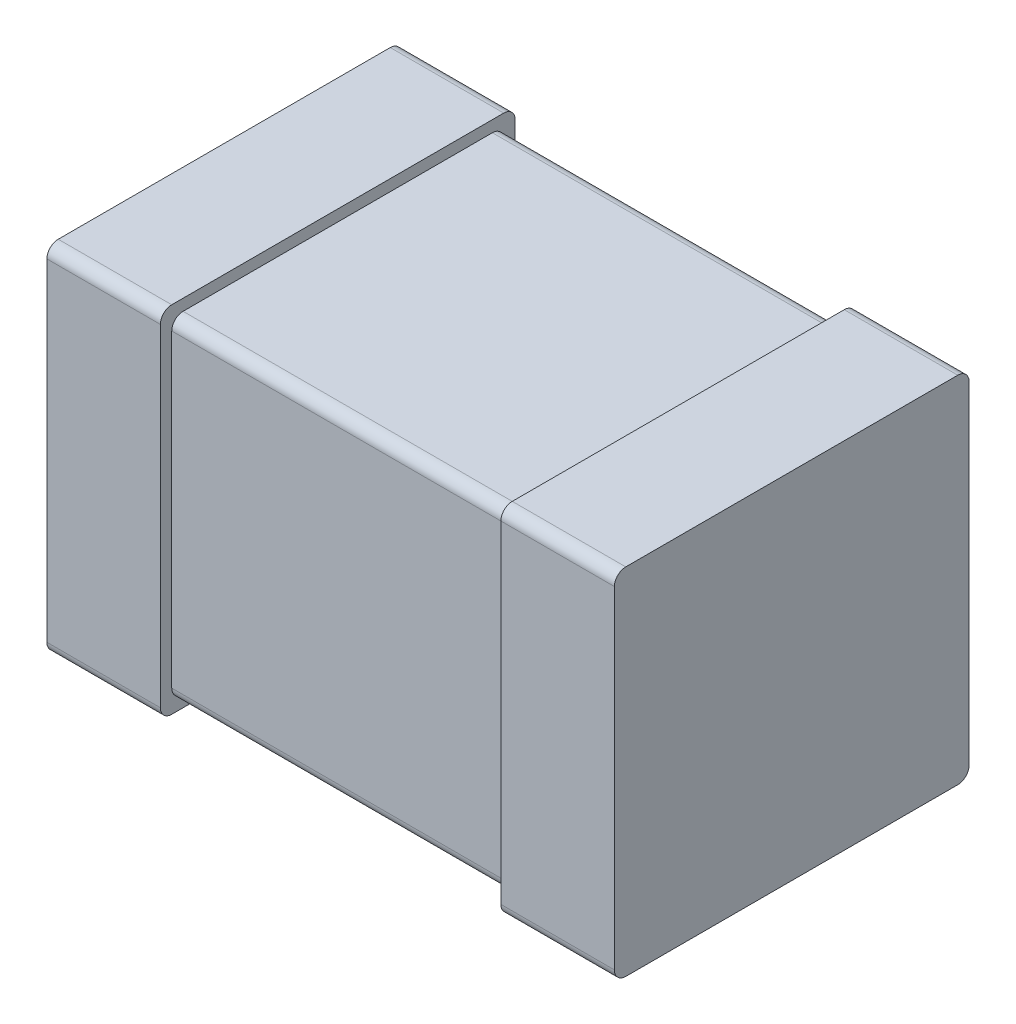
ISO-10303-21;
HEADER;
FILE_DESCRIPTION(('STEP AP214'),'2;1');
FILE_NAME('part.step','',(''),(''),'','','');
FILE_SCHEMA(('AUTOMOTIVE_DESIGN { 1 0 10303 214 1 1 1 1 }'));
ENDSEC;
DATA;
#1=APPLICATION_CONTEXT('core data for automotive mechanical design processes');
#2=APPLICATION_PROTOCOL_DEFINITION('international standard','automotive_design',2000,#1);
#3=PRODUCT_CONTEXT('',#1,'mechanical');
#4=PRODUCT('Part','Part','',(#3));
#5=PRODUCT_RELATED_PRODUCT_CATEGORY('part','',(#4));
#6=PRODUCT_DEFINITION_FORMATION('','',#4);
#7=PRODUCT_DEFINITION_CONTEXT('part definition',#1,'design');
#8=PRODUCT_DEFINITION('design','',#6,#7);
#9=PRODUCT_DEFINITION_SHAPE('','',#8);
#10=(LENGTH_UNIT() NAMED_UNIT(*) SI_UNIT(.MILLI.,.METRE.));
#11=(NAMED_UNIT(*) PLANE_ANGLE_UNIT() SI_UNIT($,.RADIAN.));
#12=(NAMED_UNIT(*) SI_UNIT($,.STERADIAN.) SOLID_ANGLE_UNIT());
#13=UNCERTAINTY_MEASURE_WITH_UNIT(LENGTH_MEASURE(1.E-05),#10,'distance_accuracy_value','');
#14=(GEOMETRIC_REPRESENTATION_CONTEXT(3) GLOBAL_UNCERTAINTY_ASSIGNED_CONTEXT((#13)) GLOBAL_UNIT_ASSIGNED_CONTEXT((#10,
#11,#12)) REPRESENTATION_CONTEXT('',''));
#15=CARTESIAN_POINT('',(0.,0.,0.));
#16=DIRECTION('',(0.,0.,1.));
#17=DIRECTION('',(1.,0.,0.));
#18=AXIS2_PLACEMENT_3D('',#15,#16,#17);
#19=CARTESIAN_POINT('',(1.,-0.625,0.));
#20=DIRECTION('',(1.,0.,0.));
#21=DIRECTION('',(0.,1.,0.));
#22=AXIS2_PLACEMENT_3D('',#19,#20,#21);
#23=PLANE('',#22);
#24=DIRECTION('',(0.,0.,1.));
#25=VECTOR('',#24,1.);
#26=CARTESIAN_POINT('',(1.,-0.625,0.));
#27=LINE('',#26,#25);
#28=CARTESIAN_POINT('',(1.,-0.625,0.04));
#29=VERTEX_POINT('',#28);
#30=CARTESIAN_POINT('',(1.,-0.625,1.21));
#31=VERTEX_POINT('',#30);
#32=EDGE_CURVE('E383',#29,#31,#27,.T.);
#33=ORIENTED_EDGE('',*,*,#32,.F.);
#34=CARTESIAN_POINT('',(1.,-0.585,0.04));
#35=DIRECTION('',(1.,0.,0.));
#36=DIRECTION('',(0.,0.,1.));
#37=AXIS2_PLACEMENT_3D('',#34,#35,#36);
#38=CIRCLE('',#37,0.04);
#39=CARTESIAN_POINT('',(1.,-0.585,0.));
#40=VERTEX_POINT('',#39);
#41=EDGE_CURVE('E272',#29,#40,#38,.T.);
#42=ORIENTED_EDGE('',*,*,#41,.T.);
#43=DIRECTION('',(0.,1.,0.));
#44=VECTOR('',#43,1.);
#45=CARTESIAN_POINT('',(1.,-0.625,0.));
#46=LINE('',#45,#44);
#47=CARTESIAN_POINT('',(1.,0.585,0.));
#48=VERTEX_POINT('',#47);
#49=EDGE_CURVE('E423',#40,#48,#46,.T.);
#50=ORIENTED_EDGE('',*,*,#49,.T.);
#51=CARTESIAN_POINT('',(1.,0.585,0.04));
#52=DIRECTION('',(-1.,0.,0.));
#53=DIRECTION('',(0.,0.,1.));
#54=AXIS2_PLACEMENT_3D('',#51,#52,#53);
#55=CIRCLE('',#54,0.04);
#56=CARTESIAN_POINT('',(1.,0.625,0.04));
#57=VERTEX_POINT('',#56);
#58=EDGE_CURVE('E302',#57,#48,#55,.T.);
#59=ORIENTED_EDGE('',*,*,#58,.F.);
#60=DIRECTION('',(0.,0.,1.));
#61=VECTOR('',#60,1.);
#62=CARTESIAN_POINT('',(1.,0.625,0.));
#63=LINE('',#62,#61);
#64=CARTESIAN_POINT('',(1.,0.625,1.21));
#65=VERTEX_POINT('',#64);
#66=EDGE_CURVE('E11',#57,#65,#63,.T.);
#67=ORIENTED_EDGE('',*,*,#66,.T.);
#68=CARTESIAN_POINT('',(1.,0.585,1.21));
#69=DIRECTION('',(1.,0.,0.));
#70=DIRECTION('',(0.,0.,1.));
#71=AXIS2_PLACEMENT_3D('',#68,#69,#70);
#72=CIRCLE('',#71,0.04);
#73=CARTESIAN_POINT('',(1.,0.585,1.25));
#74=VERTEX_POINT('',#73);
#75=EDGE_CURVE('E299',#65,#74,#72,.T.);
#76=ORIENTED_EDGE('',*,*,#75,.T.);
#77=DIRECTION('',(0.,1.,0.));
#78=VECTOR('',#77,1.);
#79=CARTESIAN_POINT('',(1.,-0.625,1.25));
#80=LINE('',#79,#78);
#81=CARTESIAN_POINT('',(1.,-0.585,1.25));
#82=VERTEX_POINT('',#81);
#83=EDGE_CURVE('E427',#82,#74,#80,.T.);
#84=ORIENTED_EDGE('',*,*,#83,.F.);
#85=CARTESIAN_POINT('',(1.,-0.585,1.21));
#86=DIRECTION('',(-1.,0.,0.));
#87=DIRECTION('',(0.,0.,1.));
#88=AXIS2_PLACEMENT_3D('',#85,#86,#87);
#89=CIRCLE('',#88,0.04);
#90=EDGE_CURVE('E268',#31,#82,#89,.T.);
#91=ORIENTED_EDGE('',*,*,#90,.F.);
#92=EDGE_LOOP('',(#33,#42,#50,#59,#67,#76,#84,#91));
#93=FACE_BOUND('',#92,.T.);
#94=ADVANCED_FACE('F17',(#93),#23,.T.);
#95=CARTESIAN_POINT('',(0.6,0.625,0.));
#96=DIRECTION('',(0.,1.,0.));
#97=DIRECTION('',(1.,0.,0.));
#98=AXIS2_PLACEMENT_3D('',#95,#96,#97);
#99=PLANE('',#98);
#100=ORIENTED_EDGE('',*,*,#66,.F.);
#101=DIRECTION('',(1.,0.,0.));
#102=VECTOR('',#101,1.);
#103=CARTESIAN_POINT('',(0.6,0.625,0.04));
#104=LINE('',#103,#102);
#105=CARTESIAN_POINT('',(0.6,0.625,0.04));
#106=VERTEX_POINT('',#105);
#107=EDGE_CURVE('E309',#106,#57,#104,.T.);
#108=ORIENTED_EDGE('',*,*,#107,.F.);
#109=DIRECTION('',(0.,0.,1.));
#110=VECTOR('',#109,1.);
#111=CARTESIAN_POINT('',(0.6,0.625,0.));
#112=LINE('',#111,#110);
#113=CARTESIAN_POINT('',(0.6,0.625,1.21));
#114=VERTEX_POINT('',#113);
#115=EDGE_CURVE('E283',#106,#114,#112,.T.);
#116=ORIENTED_EDGE('',*,*,#115,.T.);
#117=DIRECTION('',(1.,0.,0.));
#118=VECTOR('',#117,1.);
#119=CARTESIAN_POINT('',(0.6,0.625,1.21));
#120=LINE('',#119,#118);
#121=EDGE_CURVE('E25',#114,#65,#120,.T.);
#122=ORIENTED_EDGE('',*,*,#121,.T.);
#123=EDGE_LOOP('',(#100,#108,#116,#122));
#124=FACE_BOUND('',#123,.T.);
#125=ADVANCED_FACE('F440',(#124),#99,.T.);
#126=CARTESIAN_POINT('',(0.6,0.585,1.21));
#127=DIRECTION('',(1.,0.,0.));
#128=DIRECTION('',(0.,1.,0.));
#129=AXIS2_PLACEMENT_3D('',#126,#127,#128);
#130=CYLINDRICAL_SURFACE('',#129,0.04);
#131=CARTESIAN_POINT('',(0.6,0.585,1.21));
#132=DIRECTION('',(1.,0.,0.));
#133=DIRECTION('',(0.,0.,1.));
#134=AXIS2_PLACEMENT_3D('',#131,#132,#133);
#135=CIRCLE('',#134,0.04);
#136=CARTESIAN_POINT('',(0.6,0.585,1.25));
#137=VERTEX_POINT('',#136);
#138=EDGE_CURVE('E288',#114,#137,#135,.T.);
#139=ORIENTED_EDGE('',*,*,#138,.T.);
#140=DIRECTION('',(1.,0.,0.));
#141=VECTOR('',#140,1.);
#142=CARTESIAN_POINT('',(0.6,0.585,1.25));
#143=LINE('',#142,#141);
#144=EDGE_CURVE('E431',#137,#74,#143,.T.);
#145=ORIENTED_EDGE('',*,*,#144,.T.);
#146=ORIENTED_EDGE('',*,*,#75,.F.);
#147=ORIENTED_EDGE('',*,*,#121,.F.);
#148=EDGE_LOOP('',(#139,#145,#146,#147));
#149=FACE_BOUND('',#148,.T.);
#150=ADVANCED_FACE('F444',(#149),#130,.T.);
#151=CARTESIAN_POINT('',(0.6,0.585,0.04));
#152=DIRECTION('',(1.,0.,0.));
#153=DIRECTION('',(0.,1.,0.));
#154=AXIS2_PLACEMENT_3D('',#151,#152,#153);
#155=CYLINDRICAL_SURFACE('',#154,0.04);
#156=ORIENTED_EDGE('',*,*,#107,.T.);
#157=ORIENTED_EDGE('',*,*,#58,.T.);
#158=DIRECTION('',(1.,0.,0.));
#159=VECTOR('',#158,1.);
#160=CARTESIAN_POINT('',(0.6,0.585,0.));
#161=LINE('',#160,#159);
#162=CARTESIAN_POINT('',(0.6,0.585,0.));
#163=VERTEX_POINT('',#162);
#164=EDGE_CURVE('E419',#163,#48,#161,.T.);
#165=ORIENTED_EDGE('',*,*,#164,.F.);
#166=CARTESIAN_POINT('',(0.6,0.585,0.04));
#167=DIRECTION('',(-1.,0.,0.));
#168=DIRECTION('',(0.,0.,1.));
#169=AXIS2_PLACEMENT_3D('',#166,#167,#168);
#170=CIRCLE('',#169,0.04);
#171=EDGE_CURVE('E287',#106,#163,#170,.T.);
#172=ORIENTED_EDGE('',*,*,#171,.F.);
#173=EDGE_LOOP('',(#156,#157,#165,#172));
#174=FACE_BOUND('',#173,.T.);
#175=ADVANCED_FACE('F465',(#174),#155,.T.);
#176=CARTESIAN_POINT('',(0.6,-0.625,1.25));
#177=DIRECTION('',(0.,0.,1.));
#178=DIRECTION('',(1.,0.,0.));
#179=AXIS2_PLACEMENT_3D('',#176,#177,#178);
#180=PLANE('',#179);
#181=DIRECTION('',(0.,1.,0.));
#182=VECTOR('',#181,1.);
#183=CARTESIAN_POINT('',(0.6,-0.625,1.25));
#184=LINE('',#183,#182);
#185=CARTESIAN_POINT('',(0.6,-0.585,1.25));
#186=VERTEX_POINT('',#185);
#187=EDGE_CURVE('E293',#186,#137,#184,.T.);
#188=ORIENTED_EDGE('',*,*,#187,.F.);
#189=DIRECTION('',(1.,0.,0.));
#190=VECTOR('',#189,1.);
#191=CARTESIAN_POINT('',(0.6,-0.585,1.25));
#192=LINE('',#191,#190);
#193=EDGE_CURVE('E271',#186,#82,#192,.T.);
#194=ORIENTED_EDGE('',*,*,#193,.T.);
#195=ORIENTED_EDGE('',*,*,#83,.T.);
#196=ORIENTED_EDGE('',*,*,#144,.F.);
#197=EDGE_LOOP('',(#188,#194,#195,#196));
#198=FACE_BOUND('',#197,.T.);
#199=ADVANCED_FACE('F448',(#198),#180,.T.);
#200=CARTESIAN_POINT('',(0.6,-0.625,0.));
#201=DIRECTION('',(0.,0.,1.));
#202=DIRECTION('',(1.,0.,0.));
#203=AXIS2_PLACEMENT_3D('',#200,#201,#202);
#204=PLANE('',#203);
#205=ORIENTED_EDGE('',*,*,#164,.T.);
#206=ORIENTED_EDGE('',*,*,#49,.F.);
#207=DIRECTION('',(1.,0.,0.));
#208=VECTOR('',#207,1.);
#209=CARTESIAN_POINT('',(0.6,-0.585,0.));
#210=LINE('',#209,#208);
#211=CARTESIAN_POINT('',(0.6,-0.585,0.));
#212=VERTEX_POINT('',#211);
#213=EDGE_CURVE('E327',#212,#40,#210,.T.);
#214=ORIENTED_EDGE('',*,*,#213,.F.);
#215=DIRECTION('',(0.,1.,0.));
#216=VECTOR('',#215,1.);
#217=CARTESIAN_POINT('',(0.6,-0.625,0.));
#218=LINE('',#217,#216);
#219=EDGE_CURVE('E393',#212,#163,#218,.T.);
#220=ORIENTED_EDGE('',*,*,#219,.T.);
#221=EDGE_LOOP('',(#205,#206,#214,#220));
#222=FACE_BOUND('',#221,.T.);
#223=ADVANCED_FACE('F462',(#222),#204,.F.);
#224=CARTESIAN_POINT('',(0.6,-0.585,1.21));
#225=DIRECTION('',(1.,0.,0.));
#226=DIRECTION('',(0.,-1.,0.));
#227=AXIS2_PLACEMENT_3D('',#224,#225,#226);
#228=CYLINDRICAL_SURFACE('',#227,0.04);
#229=DIRECTION('',(1.,0.,0.));
#230=VECTOR('',#229,1.);
#231=CARTESIAN_POINT('',(0.6,-0.625,1.21));
#232=LINE('',#231,#230);
#233=CARTESIAN_POINT('',(0.6,-0.625,1.21));
#234=VERTEX_POINT('',#233);
#235=EDGE_CURVE('E405',#234,#31,#232,.T.);
#236=ORIENTED_EDGE('',*,*,#235,.T.);
#237=ORIENTED_EDGE('',*,*,#90,.T.);
#238=ORIENTED_EDGE('',*,*,#193,.F.);
#239=CARTESIAN_POINT('',(0.6,-0.585,1.21));
#240=DIRECTION('',(-1.,0.,0.));
#241=DIRECTION('',(0.,0.,1.));
#242=AXIS2_PLACEMENT_3D('',#239,#240,#241);
#243=CIRCLE('',#242,0.04);
#244=EDGE_CURVE('E289',#234,#186,#243,.T.);
#245=ORIENTED_EDGE('',*,*,#244,.F.);
#246=EDGE_LOOP('',(#236,#237,#238,#245));
#247=FACE_BOUND('',#246,.T.);
#248=ADVANCED_FACE('F451',(#247),#228,.T.);
#249=CARTESIAN_POINT('',(0.6,-0.585,0.04));
#250=DIRECTION('',(1.,0.,0.));
#251=DIRECTION('',(0.,-1.,0.));
#252=AXIS2_PLACEMENT_3D('',#249,#250,#251);
#253=CYLINDRICAL_SURFACE('',#252,0.04);
#254=CARTESIAN_POINT('',(0.6,-0.585,0.04));
#255=DIRECTION('',(1.,0.,0.));
#256=DIRECTION('',(0.,0.,1.));
#257=AXIS2_PLACEMENT_3D('',#254,#255,#256);
#258=CIRCLE('',#257,0.04);
#259=CARTESIAN_POINT('',(0.6,-0.625,0.04));
#260=VERTEX_POINT('',#259);
#261=EDGE_CURVE('E397',#260,#212,#258,.T.);
#262=ORIENTED_EDGE('',*,*,#261,.T.);
#263=ORIENTED_EDGE('',*,*,#213,.T.);
#264=ORIENTED_EDGE('',*,*,#41,.F.);
#265=DIRECTION('',(1.,0.,0.));
#266=VECTOR('',#265,1.);
#267=CARTESIAN_POINT('',(0.6,-0.625,0.04));
#268=LINE('',#267,#266);
#269=EDGE_CURVE('E409',#260,#29,#268,.T.);
#270=ORIENTED_EDGE('',*,*,#269,.F.);
#271=EDGE_LOOP('',(#262,#263,#264,#270));
#272=FACE_BOUND('',#271,.T.);
#273=ADVANCED_FACE('F460',(#272),#253,.T.);
#274=CARTESIAN_POINT('',(0.6,-0.625,0.));
#275=DIRECTION('',(0.,1.,0.));
#276=DIRECTION('',(1.,0.,0.));
#277=AXIS2_PLACEMENT_3D('',#274,#275,#276);
#278=PLANE('',#277);
#279=ORIENTED_EDGE('',*,*,#235,.F.);
#280=DIRECTION('',(0.,0.,1.));
#281=VECTOR('',#280,1.);
#282=CARTESIAN_POINT('',(0.6,-0.625,0.));
#283=LINE('',#282,#281);
#284=EDGE_CURVE('E401',#260,#234,#283,.T.);
#285=ORIENTED_EDGE('',*,*,#284,.F.);
#286=ORIENTED_EDGE('',*,*,#269,.T.);
#287=ORIENTED_EDGE('',*,*,#32,.T.);
#288=EDGE_LOOP('',(#279,#285,#286,#287));
#289=FACE_BOUND('',#288,.T.);
#290=ADVANCED_FACE('F454',(#289),#278,.F.);
#291=CARTESIAN_POINT('',(0.6,-0.625,0.));
#292=DIRECTION('',(1.,0.,0.));
#293=DIRECTION('',(0.,1.,0.));
#294=AXIS2_PLACEMENT_3D('',#291,#292,#293);
#295=PLANE('',#294);
#296=DIRECTION('',(0.,1.,0.));
#297=VECTOR('',#296,1.);
#298=CARTESIAN_POINT('',(0.6,-0.585,0.04));
#299=LINE('',#298,#297);
#300=CARTESIAN_POINT('',(0.6,-0.545,0.04));
#301=VERTEX_POINT('',#300);
#302=CARTESIAN_POINT('',(0.6,0.545,0.04));
#303=VERTEX_POINT('',#302);
#304=EDGE_CURVE('E354',#301,#303,#299,.T.);
#305=ORIENTED_EDGE('',*,*,#304,.T.);
#306=CARTESIAN_POINT('',(0.6,0.545,0.08));
#307=DIRECTION('',(-1.,0.,0.));
#308=DIRECTION('',(0.,0.,1.));
#309=AXIS2_PLACEMENT_3D('',#306,#307,#308);
#310=CIRCLE('',#309,0.04);
#311=CARTESIAN_POINT('',(0.6,0.585,0.08));
#312=VERTEX_POINT('',#311);
#313=EDGE_CURVE('E340',#312,#303,#310,.T.);
#314=ORIENTED_EDGE('',*,*,#313,.F.);
#315=DIRECTION('',(0.,0.,1.));
#316=VECTOR('',#315,1.);
#317=CARTESIAN_POINT('',(0.6,0.585,0.04));
#318=LINE('',#317,#316);
#319=CARTESIAN_POINT('',(0.6,0.585,1.17));
#320=VERTEX_POINT('',#319);
#321=EDGE_CURVE('E343',#312,#320,#318,.T.);
#322=ORIENTED_EDGE('',*,*,#321,.T.);
#323=CARTESIAN_POINT('',(0.6,0.545,1.17));
#324=DIRECTION('',(1.,0.,0.));
#325=DIRECTION('',(0.,0.,1.));
#326=AXIS2_PLACEMENT_3D('',#323,#324,#325);
#327=CIRCLE('',#326,0.04);
#328=CARTESIAN_POINT('',(0.6,0.545,1.21));
#329=VERTEX_POINT('',#328);
#330=EDGE_CURVE('E366',#320,#329,#327,.T.);
#331=ORIENTED_EDGE('',*,*,#330,.T.);
#332=DIRECTION('',(0.,1.,0.));
#333=VECTOR('',#332,1.);
#334=CARTESIAN_POINT('',(0.6,-0.585,1.21));
#335=LINE('',#334,#333);
#336=CARTESIAN_POINT('',(0.6,-0.545,1.21));
#337=VERTEX_POINT('',#336);
#338=EDGE_CURVE('E374',#337,#329,#335,.T.);
#339=ORIENTED_EDGE('',*,*,#338,.F.);
#340=CARTESIAN_POINT('',(0.6,-0.545,1.17));
#341=DIRECTION('',(-1.,0.,0.));
#342=DIRECTION('',(0.,0.,1.));
#343=AXIS2_PLACEMENT_3D('',#340,#341,#342);
#344=CIRCLE('',#343,0.04);
#345=CARTESIAN_POINT('',(0.6,-0.585,1.17));
#346=VERTEX_POINT('',#345);
#347=EDGE_CURVE('E330',#346,#337,#344,.T.);
#348=ORIENTED_EDGE('',*,*,#347,.F.);
#349=DIRECTION('',(0.,0.,1.));
#350=VECTOR('',#349,1.);
#351=CARTESIAN_POINT('',(0.6,-0.585,0.04));
#352=LINE('',#351,#350);
#353=CARTESIAN_POINT('',(0.6,-0.585,0.08));
#354=VERTEX_POINT('',#353);
#355=EDGE_CURVE('E294',#354,#346,#352,.T.);
#356=ORIENTED_EDGE('',*,*,#355,.F.);
#357=CARTESIAN_POINT('',(0.6,-0.545,0.08));
#358=DIRECTION('',(1.,0.,0.));
#359=DIRECTION('',(0.,0.,1.));
#360=AXIS2_PLACEMENT_3D('',#357,#358,#359);
#361=CIRCLE('',#360,0.04);
#362=EDGE_CURVE('E319',#354,#301,#361,.T.);
#363=ORIENTED_EDGE('',*,*,#362,.T.);
#364=EDGE_LOOP('',(#305,#314,#322,#331,#339,#348,#356,#363));
#365=FACE_BOUND('',#364,.T.);
#366=ORIENTED_EDGE('',*,*,#244,.T.);
#367=ORIENTED_EDGE('',*,*,#187,.T.);
#368=ORIENTED_EDGE('',*,*,#138,.F.);
#369=ORIENTED_EDGE('',*,*,#115,.F.);
#370=ORIENTED_EDGE('',*,*,#171,.T.);
#371=ORIENTED_EDGE('',*,*,#219,.F.);
#372=ORIENTED_EDGE('',*,*,#261,.F.);
#373=ORIENTED_EDGE('',*,*,#284,.T.);
#374=EDGE_LOOP('',(#366,#367,#368,#369,#370,#371,#372,#373));
#375=FACE_BOUND('',#374,.T.);
#376=ADVANCED_FACE('F457',(#365,#375),#295,.F.);
#377=CARTESIAN_POINT('',(-0.6,-0.585,0.04));
#378=DIRECTION('',(0.,1.,0.));
#379=DIRECTION('',(1.,0.,0.));
#380=AXIS2_PLACEMENT_3D('',#377,#378,#379);
#381=PLANE('',#380);
#382=DIRECTION('',(1.,0.,0.));
#383=VECTOR('',#382,1.);
#384=CARTESIAN_POINT('',(-0.6,-0.585,1.17));
#385=LINE('',#384,#383);
#386=CARTESIAN_POINT('',(-0.6,-0.585,1.17));
#387=VERTEX_POINT('',#386);
#388=EDGE_CURVE('E377',#387,#346,#385,.T.);
#389=ORIENTED_EDGE('',*,*,#388,.F.);
#390=DIRECTION('',(0.,0.,1.));
#391=VECTOR('',#390,1.);
#392=CARTESIAN_POINT('',(-0.6,-0.585,0.04));
#393=LINE('',#392,#391);
#394=CARTESIAN_POINT('',(-0.6,-0.585,0.08));
#395=VERTEX_POINT('',#394);
#396=EDGE_CURVE('E298',#395,#387,#393,.T.);
#397=ORIENTED_EDGE('',*,*,#396,.F.);
#398=DIRECTION('',(1.,0.,0.));
#399=VECTOR('',#398,1.);
#400=CARTESIAN_POINT('',(-0.6,-0.585,0.08));
#401=LINE('',#400,#399);
#402=EDGE_CURVE('E314',#395,#354,#401,.T.);
#403=ORIENTED_EDGE('',*,*,#402,.T.);
#404=ORIENTED_EDGE('',*,*,#355,.T.);
#405=EDGE_LOOP('',(#389,#397,#403,#404));
#406=FACE_BOUND('',#405,.T.);
#407=ADVANCED_FACE('F552',(#406),#381,.F.);
#408=CARTESIAN_POINT('',(-0.6,-0.545,1.17));
#409=DIRECTION('',(1.,0.,0.));
#410=DIRECTION('',(0.,-1.,0.));
#411=AXIS2_PLACEMENT_3D('',#408,#409,#410);
#412=CYLINDRICAL_SURFACE('',#411,0.04);
#413=ORIENTED_EDGE('',*,*,#388,.T.);
#414=ORIENTED_EDGE('',*,*,#347,.T.);
#415=DIRECTION('',(1.,0.,0.));
#416=VECTOR('',#415,1.);
#417=CARTESIAN_POINT('',(-0.6,-0.545,1.21));
#418=LINE('',#417,#416);
#419=CARTESIAN_POINT('',(-0.6,-0.545,1.21));
#420=VERTEX_POINT('',#419);
#421=EDGE_CURVE('E370',#420,#337,#418,.T.);
#422=ORIENTED_EDGE('',*,*,#421,.F.);
#423=CARTESIAN_POINT('',(-0.6,-0.545,1.17));
#424=DIRECTION('',(-1.,0.,0.));
#425=DIRECTION('',(0.,0.,1.));
#426=AXIS2_PLACEMENT_3D('',#423,#424,#425);
#427=CIRCLE('',#426,0.04);
#428=EDGE_CURVE('E306',#387,#420,#427,.T.);
#429=ORIENTED_EDGE('',*,*,#428,.F.);
#430=EDGE_LOOP('',(#413,#414,#422,#429));
#431=FACE_BOUND('',#430,.T.);
#432=ADVANCED_FACE('F564',(#431),#412,.T.);
#433=CARTESIAN_POINT('',(-0.6,-0.585,1.21));
#434=DIRECTION('',(0.,0.,1.));
#435=DIRECTION('',(1.,0.,0.));
#436=AXIS2_PLACEMENT_3D('',#433,#434,#435);
#437=PLANE('',#436);
#438=DIRECTION('',(0.,1.,0.));
#439=VECTOR('',#438,1.);
#440=CARTESIAN_POINT('',(-0.6,-0.585,1.21));
#441=LINE('',#440,#439);
#442=CARTESIAN_POINT('',(-0.6,0.545,1.21));
#443=VERTEX_POINT('',#442);
#444=EDGE_CURVE('E313',#420,#443,#441,.T.);
#445=ORIENTED_EDGE('',*,*,#444,.F.);
#446=ORIENTED_EDGE('',*,*,#421,.T.);
#447=ORIENTED_EDGE('',*,*,#338,.T.);
#448=DIRECTION('',(1.,0.,0.));
#449=VECTOR('',#448,1.);
#450=CARTESIAN_POINT('',(-0.6,0.545,1.21));
#451=LINE('',#450,#449);
#452=EDGE_CURVE('E362',#443,#329,#451,.T.);
#453=ORIENTED_EDGE('',*,*,#452,.F.);
#454=EDGE_LOOP('',(#445,#446,#447,#453));
#455=FACE_BOUND('',#454,.T.);
#456=ADVANCED_FACE('F577',(#455),#437,.T.);
#457=CARTESIAN_POINT('',(-0.6,0.545,1.17));
#458=DIRECTION('',(1.,0.,0.));
#459=DIRECTION('',(0.,1.,0.));
#460=AXIS2_PLACEMENT_3D('',#457,#458,#459);
#461=CYLINDRICAL_SURFACE('',#460,0.04);
#462=CARTESIAN_POINT('',(-0.6,0.545,1.17));
#463=DIRECTION('',(1.,0.,0.));
#464=DIRECTION('',(0.,0.,1.));
#465=AXIS2_PLACEMENT_3D('',#462,#463,#464);
#466=CIRCLE('',#465,0.04);
#467=CARTESIAN_POINT('',(-0.6,0.585,1.17));
#468=VERTEX_POINT('',#467);
#469=EDGE_CURVE('E323',#468,#443,#466,.T.);
#470=ORIENTED_EDGE('',*,*,#469,.T.);
#471=ORIENTED_EDGE('',*,*,#452,.T.);
#472=ORIENTED_EDGE('',*,*,#330,.F.);
#473=DIRECTION('',(1.,0.,0.));
#474=VECTOR('',#473,1.);
#475=CARTESIAN_POINT('',(-0.6,0.585,1.17));
#476=LINE('',#475,#474);
#477=EDGE_CURVE('E358',#468,#320,#476,.T.);
#478=ORIENTED_EDGE('',*,*,#477,.F.);
#479=EDGE_LOOP('',(#470,#471,#472,#478));
#480=FACE_BOUND('',#479,.T.);
#481=ADVANCED_FACE('F590',(#480),#461,.T.);
#482=CARTESIAN_POINT('',(-0.6,0.585,0.04));
#483=DIRECTION('',(0.,1.,0.));
#484=DIRECTION('',(1.,0.,0.));
#485=AXIS2_PLACEMENT_3D('',#482,#483,#484);
#486=PLANE('',#485);
#487=ORIENTED_EDGE('',*,*,#321,.F.);
#488=DIRECTION('',(1.,0.,0.));
#489=VECTOR('',#488,1.);
#490=CARTESIAN_POINT('',(-0.6,0.585,0.08));
#491=LINE('',#490,#489);
#492=CARTESIAN_POINT('',(-0.6,0.585,0.08));
#493=VERTEX_POINT('',#492);
#494=EDGE_CURVE('E267',#493,#312,#491,.T.);
#495=ORIENTED_EDGE('',*,*,#494,.F.);
#496=DIRECTION('',(0.,0.,1.));
#497=VECTOR('',#496,1.);
#498=CARTESIAN_POINT('',(-0.6,0.585,0.04));
#499=LINE('',#498,#497);
#500=EDGE_CURVE('E334',#493,#468,#499,.T.);
#501=ORIENTED_EDGE('',*,*,#500,.T.);
#502=ORIENTED_EDGE('',*,*,#477,.T.);
#503=EDGE_LOOP('',(#487,#495,#501,#502));
#504=FACE_BOUND('',#503,.T.);
#505=ADVANCED_FACE('F603',(#504),#486,.T.);
#506=CARTESIAN_POINT('',(-0.6,0.545,0.08));
#507=DIRECTION('',(1.,0.,0.));
#508=DIRECTION('',(0.,1.,0.));
#509=AXIS2_PLACEMENT_3D('',#506,#507,#508);
#510=CYLINDRICAL_SURFACE('',#509,0.04);
#511=ORIENTED_EDGE('',*,*,#494,.T.);
#512=ORIENTED_EDGE('',*,*,#313,.T.);
#513=DIRECTION('',(1.,0.,0.));
#514=VECTOR('',#513,1.);
#515=CARTESIAN_POINT('',(-0.6,0.545,0.04));
#516=LINE('',#515,#514);
#517=CARTESIAN_POINT('',(-0.6,0.545,0.04));
#518=VERTEX_POINT('',#517);
#519=EDGE_CURVE('E318',#518,#303,#516,.T.);
#520=ORIENTED_EDGE('',*,*,#519,.F.);
#521=CARTESIAN_POINT('',(-0.6,0.545,0.08));
#522=DIRECTION('',(-1.,0.,0.));
#523=DIRECTION('',(0.,0.,1.));
#524=AXIS2_PLACEMENT_3D('',#521,#522,#523);
#525=CIRCLE('',#524,0.04);
#526=EDGE_CURVE('E335',#493,#518,#525,.T.);
#527=ORIENTED_EDGE('',*,*,#526,.F.);
#528=EDGE_LOOP('',(#511,#512,#520,#527));
#529=FACE_BOUND('',#528,.T.);
#530=ADVANCED_FACE('F615',(#529),#510,.T.);
#531=CARTESIAN_POINT('',(-0.6,-0.585,0.04));
#532=DIRECTION('',(0.,0.,1.));
#533=DIRECTION('',(1.,0.,0.));
#534=AXIS2_PLACEMENT_3D('',#531,#532,#533);
#535=PLANE('',#534);
#536=ORIENTED_EDGE('',*,*,#519,.T.);
#537=ORIENTED_EDGE('',*,*,#304,.F.);
#538=DIRECTION('',(1.,0.,0.));
#539=VECTOR('',#538,1.);
#540=CARTESIAN_POINT('',(-0.6,-0.545,0.04));
#541=LINE('',#540,#539);
#542=CARTESIAN_POINT('',(-0.6,-0.545,0.04));
#543=VERTEX_POINT('',#542);
#544=EDGE_CURVE('E344',#543,#301,#541,.T.);
#545=ORIENTED_EDGE('',*,*,#544,.F.);
#546=DIRECTION('',(0.,1.,0.));
#547=VECTOR('',#546,1.);
#548=CARTESIAN_POINT('',(-0.6,-0.585,0.04));
#549=LINE('',#548,#547);
#550=EDGE_CURVE('E339',#543,#518,#549,.T.);
#551=ORIENTED_EDGE('',*,*,#550,.T.);
#552=EDGE_LOOP('',(#536,#537,#545,#551));
#553=FACE_BOUND('',#552,.T.);
#554=ADVANCED_FACE('F627',(#553),#535,.F.);
#555=CARTESIAN_POINT('',(-0.6,-0.545,0.08));
#556=DIRECTION('',(1.,0.,0.));
#557=DIRECTION('',(0.,-1.,0.));
#558=AXIS2_PLACEMENT_3D('',#555,#556,#557);
#559=CYLINDRICAL_SURFACE('',#558,0.04);
#560=CARTESIAN_POINT('',(-0.6,-0.545,0.08));
#561=DIRECTION('',(1.,0.,0.));
#562=DIRECTION('',(0.,0.,1.));
#563=AXIS2_PLACEMENT_3D('',#560,#561,#562);
#564=CIRCLE('',#563,0.04);
#565=EDGE_CURVE('E282',#395,#543,#564,.T.);
#566=ORIENTED_EDGE('',*,*,#565,.T.);
#567=ORIENTED_EDGE('',*,*,#544,.T.);
#568=ORIENTED_EDGE('',*,*,#362,.F.);
#569=ORIENTED_EDGE('',*,*,#402,.F.);
#570=EDGE_LOOP('',(#566,#567,#568,#569));
#571=FACE_BOUND('',#570,.T.);
#572=ADVANCED_FACE('F639',(#571),#559,.T.);
#573=CARTESIAN_POINT('',(-0.6,-0.625,0.));
#574=DIRECTION('',(1.,0.,0.));
#575=DIRECTION('',(0.,1.,0.));
#576=AXIS2_PLACEMENT_3D('',#573,#574,#575);
#577=PLANE('',#576);
#578=ORIENTED_EDGE('',*,*,#565,.F.);
#579=ORIENTED_EDGE('',*,*,#396,.T.);
#580=ORIENTED_EDGE('',*,*,#428,.T.);
#581=ORIENTED_EDGE('',*,*,#444,.T.);
#582=ORIENTED_EDGE('',*,*,#469,.F.);
#583=ORIENTED_EDGE('',*,*,#500,.F.);
#584=ORIENTED_EDGE('',*,*,#526,.T.);
#585=ORIENTED_EDGE('',*,*,#550,.F.);
#586=EDGE_LOOP('',(#578,#579,#580,#581,#582,#583,#584,#585));
#587=FACE_BOUND('',#586,.T.);
#588=DIRECTION('',(0.,0.,1.));
#589=VECTOR('',#588,1.);
#590=CARTESIAN_POINT('',(-0.6,-0.625,0.));
#591=LINE('',#590,#589);
#592=CARTESIAN_POINT('',(-0.6,-0.625,0.04));
#593=VERTEX_POINT('',#592);
#594=CARTESIAN_POINT('',(-0.6,-0.625,1.21));
#595=VERTEX_POINT('',#594);
#596=EDGE_CURVE('E852',#593,#595,#591,.T.);
#597=ORIENTED_EDGE('',*,*,#596,.F.);
#598=CARTESIAN_POINT('',(-0.6,-0.585,0.04));
#599=DIRECTION('',(1.,0.,0.));
#600=DIRECTION('',(0.,0.,1.));
#601=AXIS2_PLACEMENT_3D('',#598,#599,#600);
#602=CIRCLE('',#601,0.04);
#603=CARTESIAN_POINT('',(-0.6,-0.585,0.));
#604=VERTEX_POINT('',#603);
#605=EDGE_CURVE('E839',#593,#604,#602,.T.);
#606=ORIENTED_EDGE('',*,*,#605,.T.);
#607=DIRECTION('',(0.,1.,0.));
#608=VECTOR('',#607,1.);
#609=CARTESIAN_POINT('',(-0.6,-0.625,0.));
#610=LINE('',#609,#608);
#611=CARTESIAN_POINT('',(-0.6,0.585,0.));
#612=VERTEX_POINT('',#611);
#613=EDGE_CURVE('E256',#604,#612,#610,.T.);
#614=ORIENTED_EDGE('',*,*,#613,.T.);
#615=CARTESIAN_POINT('',(-0.6,0.585,0.04));
#616=DIRECTION('',(-1.,0.,0.));
#617=DIRECTION('',(0.,0.,1.));
#618=AXIS2_PLACEMENT_3D('',#615,#616,#617);
#619=CIRCLE('',#618,0.04);
#620=CARTESIAN_POINT('',(-0.6,0.625,0.04));
#621=VERTEX_POINT('',#620);
#622=EDGE_CURVE('E239',#621,#612,#619,.T.);
#623=ORIENTED_EDGE('',*,*,#622,.F.);
#624=DIRECTION('',(0.,0.,1.));
#625=VECTOR('',#624,1.);
#626=CARTESIAN_POINT('',(-0.6,0.625,0.));
#627=LINE('',#626,#625);
#628=CARTESIAN_POINT('',(-0.6,0.625,1.21));
#629=VERTEX_POINT('',#628);
#630=EDGE_CURVE('E234',#621,#629,#627,.T.);
#631=ORIENTED_EDGE('',*,*,#630,.T.);
#632=CARTESIAN_POINT('',(-0.6,0.585,1.21));
#633=DIRECTION('',(1.,0.,0.));
#634=DIRECTION('',(0.,0.,1.));
#635=AXIS2_PLACEMENT_3D('',#632,#633,#634);
#636=CIRCLE('',#635,0.04);
#637=CARTESIAN_POINT('',(-0.6,0.585,1.25));
#638=VERTEX_POINT('',#637);
#639=EDGE_CURVE('E226',#629,#638,#636,.T.);
#640=ORIENTED_EDGE('',*,*,#639,.T.);
#641=DIRECTION('',(0.,1.,0.));
#642=VECTOR('',#641,1.);
#643=CARTESIAN_POINT('',(-0.6,-0.625,1.25));
#644=LINE('',#643,#642);
#645=CARTESIAN_POINT('',(-0.6,-0.585,1.25));
#646=VERTEX_POINT('',#645);
#647=EDGE_CURVE('E231',#646,#638,#644,.T.);
#648=ORIENTED_EDGE('',*,*,#647,.F.);
#649=CARTESIAN_POINT('',(-0.6,-0.585,1.21));
#650=DIRECTION('',(-1.,0.,0.));
#651=DIRECTION('',(0.,0.,1.));
#652=AXIS2_PLACEMENT_3D('',#649,#650,#651);
#653=CIRCLE('',#652,0.04);
#654=EDGE_CURVE('E836',#595,#646,#653,.T.);
#655=ORIENTED_EDGE('',*,*,#654,.F.);
#656=EDGE_LOOP('',(#597,#606,#614,#623,#631,#640,#648,#655));
#657=FACE_BOUND('',#656,.T.);
#658=ADVANCED_FACE('F229',(#587,#657),#577,.T.);
#659=CARTESIAN_POINT('',(-1.,0.625,0.));
#660=DIRECTION('',(0.,1.,0.));
#661=DIRECTION('',(1.,0.,0.));
#662=AXIS2_PLACEMENT_3D('',#659,#660,#661);
#663=PLANE('',#662);
#664=ORIENTED_EDGE('',*,*,#630,.F.);
#665=DIRECTION('',(1.,0.,0.));
#666=VECTOR('',#665,1.);
#667=CARTESIAN_POINT('',(-1.,0.625,0.04));
#668=LINE('',#667,#666);
#669=CARTESIAN_POINT('',(-1.,0.625,0.04));
#670=VERTEX_POINT('',#669);
#671=EDGE_CURVE('E250',#670,#621,#668,.T.);
#672=ORIENTED_EDGE('',*,*,#671,.F.);
#673=DIRECTION('',(0.,0.,1.));
#674=VECTOR('',#673,1.);
#675=CARTESIAN_POINT('',(-1.,0.625,0.));
#676=LINE('',#675,#674);
#677=CARTESIAN_POINT('',(-1.,0.625,1.21));
#678=VERTEX_POINT('',#677);
#679=EDGE_CURVE('E812',#670,#678,#676,.T.);
#680=ORIENTED_EDGE('',*,*,#679,.T.);
#681=DIRECTION('',(1.,0.,0.));
#682=VECTOR('',#681,1.);
#683=CARTESIAN_POINT('',(-1.,0.625,1.21));
#684=LINE('',#683,#682);
#685=EDGE_CURVE('E238',#678,#629,#684,.T.);
#686=ORIENTED_EDGE('',*,*,#685,.T.);
#687=EDGE_LOOP('',(#664,#672,#680,#686));
#688=FACE_BOUND('',#687,.T.);
#689=ADVANCED_FACE('F659',(#688),#663,.T.);
#690=CARTESIAN_POINT('',(-1.,0.585,1.21));
#691=DIRECTION('',(1.,0.,0.));
#692=DIRECTION('',(0.,1.,0.));
#693=AXIS2_PLACEMENT_3D('',#690,#691,#692);
#694=CYLINDRICAL_SURFACE('',#693,0.04);
#695=CARTESIAN_POINT('',(-1.,0.585,1.21));
#696=DIRECTION('',(1.,0.,0.));
#697=DIRECTION('',(0.,0.,1.));
#698=AXIS2_PLACEMENT_3D('',#695,#696,#697);
#699=CIRCLE('',#698,0.04);
#700=CARTESIAN_POINT('',(-1.,0.585,1.25));
#701=VERTEX_POINT('',#700);
#702=EDGE_CURVE('E245',#678,#701,#699,.T.);
#703=ORIENTED_EDGE('',*,*,#702,.T.);
#704=DIRECTION('',(1.,0.,0.));
#705=VECTOR('',#704,1.);
#706=CARTESIAN_POINT('',(-1.,0.585,1.25));
#707=LINE('',#706,#705);
#708=EDGE_CURVE('E242',#701,#638,#707,.T.);
#709=ORIENTED_EDGE('',*,*,#708,.T.);
#710=ORIENTED_EDGE('',*,*,#639,.F.);
#711=ORIENTED_EDGE('',*,*,#685,.F.);
#712=EDGE_LOOP('',(#703,#709,#710,#711));
#713=FACE_BOUND('',#712,.T.);
#714=ADVANCED_FACE('F243',(#713),#694,.T.);
#715=CARTESIAN_POINT('',(-1.,0.585,0.04));
#716=DIRECTION('',(1.,0.,0.));
#717=DIRECTION('',(0.,1.,0.));
#718=AXIS2_PLACEMENT_3D('',#715,#716,#717);
#719=CYLINDRICAL_SURFACE('',#718,0.04);
#720=ORIENTED_EDGE('',*,*,#671,.T.);
#721=ORIENTED_EDGE('',*,*,#622,.T.);
#722=DIRECTION('',(1.,0.,0.));
#723=VECTOR('',#722,1.);
#724=CARTESIAN_POINT('',(-1.,0.585,0.));
#725=LINE('',#724,#723);
#726=CARTESIAN_POINT('',(-1.,0.585,0.));
#727=VERTEX_POINT('',#726);
#728=EDGE_CURVE('E263',#727,#612,#725,.T.);
#729=ORIENTED_EDGE('',*,*,#728,.F.);
#730=CARTESIAN_POINT('',(-1.,0.585,0.04));
#731=DIRECTION('',(-1.,0.,0.));
#732=DIRECTION('',(0.,0.,1.));
#733=AXIS2_PLACEMENT_3D('',#730,#731,#732);
#734=CIRCLE('',#733,0.04);
#735=EDGE_CURVE('E816',#670,#727,#734,.T.);
#736=ORIENTED_EDGE('',*,*,#735,.F.);
#737=EDGE_LOOP('',(#720,#721,#729,#736));
#738=FACE_BOUND('',#737,.T.);
#739=ADVANCED_FACE('F681',(#738),#719,.T.);
#740=CARTESIAN_POINT('',(-1.,-0.625,1.25));
#741=DIRECTION('',(0.,0.,1.));
#742=DIRECTION('',(1.,0.,0.));
#743=AXIS2_PLACEMENT_3D('',#740,#741,#742);
#744=PLANE('',#743);
#745=DIRECTION('',(0.,1.,0.));
#746=VECTOR('',#745,1.);
#747=CARTESIAN_POINT('',(-1.,-0.625,1.25));
#748=LINE('',#747,#746);
#749=CARTESIAN_POINT('',(-1.,-0.585,1.25));
#750=VERTEX_POINT('',#749);
#751=EDGE_CURVE('E798',#750,#701,#748,.T.);
#752=ORIENTED_EDGE('',*,*,#751,.F.);
#753=DIRECTION('',(1.,0.,0.));
#754=VECTOR('',#753,1.);
#755=CARTESIAN_POINT('',(-1.,-0.585,1.25));
#756=LINE('',#755,#754);
#757=EDGE_CURVE('E253',#750,#646,#756,.T.);
#758=ORIENTED_EDGE('',*,*,#757,.T.);
#759=ORIENTED_EDGE('',*,*,#647,.T.);
#760=ORIENTED_EDGE('',*,*,#708,.F.);
#761=EDGE_LOOP('',(#752,#758,#759,#760));
#762=FACE_BOUND('',#761,.T.);
#763=ADVANCED_FACE('F252',(#762),#744,.T.);
#764=CARTESIAN_POINT('',(-1.,-0.625,0.));
#765=DIRECTION('',(0.,0.,1.));
#766=DIRECTION('',(1.,0.,0.));
#767=AXIS2_PLACEMENT_3D('',#764,#765,#766);
#768=PLANE('',#767);
#769=ORIENTED_EDGE('',*,*,#728,.T.);
#770=ORIENTED_EDGE('',*,*,#613,.F.);
#771=DIRECTION('',(1.,0.,0.));
#772=VECTOR('',#771,1.);
#773=CARTESIAN_POINT('',(-1.,-0.585,0.));
#774=LINE('',#773,#772);
#775=CARTESIAN_POINT('',(-1.,-0.585,0.));
#776=VERTEX_POINT('',#775);
#777=EDGE_CURVE('E856',#776,#604,#774,.T.);
#778=ORIENTED_EDGE('',*,*,#777,.F.);
#779=DIRECTION('',(0.,1.,0.));
#780=VECTOR('',#779,1.);
#781=CARTESIAN_POINT('',(-1.,-0.625,0.));
#782=LINE('',#781,#780);
#783=EDGE_CURVE('E826',#776,#727,#782,.T.);
#784=ORIENTED_EDGE('',*,*,#783,.T.);
#785=EDGE_LOOP('',(#769,#770,#778,#784));
#786=FACE_BOUND('',#785,.T.);
#787=ADVANCED_FACE('F701',(#786),#768,.F.);
#788=CARTESIAN_POINT('',(-1.,-0.585,1.21));
#789=DIRECTION('',(1.,0.,0.));
#790=DIRECTION('',(0.,-1.,0.));
#791=AXIS2_PLACEMENT_3D('',#788,#789,#790);
#792=CYLINDRICAL_SURFACE('',#791,0.04);
#793=DIRECTION('',(1.,0.,0.));
#794=VECTOR('',#793,1.);
#795=CARTESIAN_POINT('',(-1.,-0.625,1.21));
#796=LINE('',#795,#794);
#797=CARTESIAN_POINT('',(-1.,-0.625,1.21));
#798=VERTEX_POINT('',#797);
#799=EDGE_CURVE('E841',#798,#595,#796,.T.);
#800=ORIENTED_EDGE('',*,*,#799,.T.);
#801=ORIENTED_EDGE('',*,*,#654,.T.);
#802=ORIENTED_EDGE('',*,*,#757,.F.);
#803=CARTESIAN_POINT('',(-1.,-0.585,1.21));
#804=DIRECTION('',(-1.,0.,0.));
#805=DIRECTION('',(0.,0.,1.));
#806=AXIS2_PLACEMENT_3D('',#803,#804,#805);
#807=CIRCLE('',#806,0.04);
#808=EDGE_CURVE('E797',#798,#750,#807,.T.);
#809=ORIENTED_EDGE('',*,*,#808,.F.);
#810=EDGE_LOOP('',(#800,#801,#802,#809));
#811=FACE_BOUND('',#810,.T.);
#812=ADVANCED_FACE('F711',(#811),#792,.T.);
#813=CARTESIAN_POINT('',(-1.,-0.585,0.04));
#814=DIRECTION('',(1.,0.,0.));
#815=DIRECTION('',(0.,-1.,0.));
#816=AXIS2_PLACEMENT_3D('',#813,#814,#815);
#817=CYLINDRICAL_SURFACE('',#816,0.04);
#818=CARTESIAN_POINT('',(-1.,-0.585,0.04));
#819=DIRECTION('',(1.,0.,0.));
#820=DIRECTION('',(0.,0.,1.));
#821=AXIS2_PLACEMENT_3D('',#818,#819,#820);
#822=CIRCLE('',#821,0.04);
#823=CARTESIAN_POINT('',(-1.,-0.625,0.04));
#824=VERTEX_POINT('',#823);
#825=EDGE_CURVE('E822',#824,#776,#822,.T.);
#826=ORIENTED_EDGE('',*,*,#825,.T.);
#827=ORIENTED_EDGE('',*,*,#777,.T.);
#828=ORIENTED_EDGE('',*,*,#605,.F.);
#829=DIRECTION('',(1.,0.,0.));
#830=VECTOR('',#829,1.);
#831=CARTESIAN_POINT('',(-1.,-0.625,0.04));
#832=LINE('',#831,#830);
#833=EDGE_CURVE('E845',#824,#593,#832,.T.);
#834=ORIENTED_EDGE('',*,*,#833,.F.);
#835=EDGE_LOOP('',(#826,#827,#828,#834));
#836=FACE_BOUND('',#835,.T.);
#837=ADVANCED_FACE('F722',(#836),#817,.T.);
#838=CARTESIAN_POINT('',(-1.,-0.625,0.));
#839=DIRECTION('',(0.,1.,0.));
#840=DIRECTION('',(1.,0.,0.));
#841=AXIS2_PLACEMENT_3D('',#838,#839,#840);
#842=PLANE('',#841);
#843=ORIENTED_EDGE('',*,*,#799,.F.);
#844=DIRECTION('',(0.,0.,1.));
#845=VECTOR('',#844,1.);
#846=CARTESIAN_POINT('',(-1.,-0.625,0.));
#847=LINE('',#846,#845);
#848=EDGE_CURVE('E801',#824,#798,#847,.T.);
#849=ORIENTED_EDGE('',*,*,#848,.F.);
#850=ORIENTED_EDGE('',*,*,#833,.T.);
#851=ORIENTED_EDGE('',*,*,#596,.T.);
#852=EDGE_LOOP('',(#843,#849,#850,#851));
#853=FACE_BOUND('',#852,.T.);
#854=ADVANCED_FACE('F732',(#853),#842,.F.);
#855=CARTESIAN_POINT('',(-1.,-0.625,0.));
#856=DIRECTION('',(1.,0.,0.));
#857=DIRECTION('',(0.,1.,0.));
#858=AXIS2_PLACEMENT_3D('',#855,#856,#857);
#859=PLANE('',#858);
#860=ORIENTED_EDGE('',*,*,#808,.T.);
#861=ORIENTED_EDGE('',*,*,#751,.T.);
#862=ORIENTED_EDGE('',*,*,#702,.F.);
#863=ORIENTED_EDGE('',*,*,#679,.F.);
#864=ORIENTED_EDGE('',*,*,#735,.T.);
#865=ORIENTED_EDGE('',*,*,#783,.F.);
#866=ORIENTED_EDGE('',*,*,#825,.F.);
#867=ORIENTED_EDGE('',*,*,#848,.T.);
#868=EDGE_LOOP('',(#860,#861,#862,#863,#864,#865,#866,#867));
#869=FACE_BOUND('',#868,.T.);
#870=ADVANCED_FACE('F742',(#869),#859,.F.);
#871=CLOSED_SHELL('',(#94,#125,#150,#175,#199,#223,#248,#273,#290,#376,#407,#432,#456,#481,#505,
#530,#554,#572,#658,#689,#714,#739,#763,#787,#812,#837,#854,#870));
#872=MANIFOLD_SOLID_BREP('B1',#871);
#873=ADVANCED_BREP_SHAPE_REPRESENTATION('',(#18,#872),#14);
#874=SHAPE_DEFINITION_REPRESENTATION(#9,#873);
ENDSEC;
END-ISO-10303-21;
